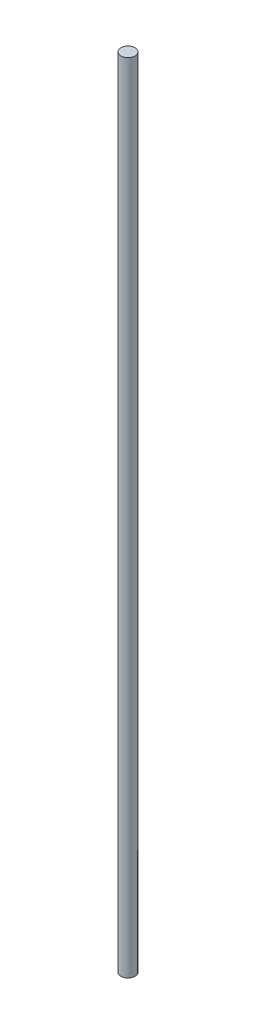
ISO-10303-21;
HEADER;
FILE_DESCRIPTION(('STEP AP214'),'2;1');
FILE_NAME('part.step','',(''),(''),'','','');
FILE_SCHEMA(('AUTOMOTIVE_DESIGN { 1 0 10303 214 1 1 1 1 }'));
ENDSEC;
DATA;
#1=APPLICATION_CONTEXT('core data for automotive mechanical design processes');
#2=APPLICATION_PROTOCOL_DEFINITION('international standard','automotive_design',2000,#1);
#3=PRODUCT_CONTEXT('',#1,'mechanical');
#4=PRODUCT('Part','Part','',(#3));
#5=PRODUCT_RELATED_PRODUCT_CATEGORY('part','',(#4));
#6=PRODUCT_DEFINITION_FORMATION('','',#4);
#7=PRODUCT_DEFINITION_CONTEXT('part definition',#1,'design');
#8=PRODUCT_DEFINITION('design','',#6,#7);
#9=PRODUCT_DEFINITION_SHAPE('','',#8);
#10=(LENGTH_UNIT() NAMED_UNIT(*) SI_UNIT(.MILLI.,.METRE.));
#11=(NAMED_UNIT(*) PLANE_ANGLE_UNIT() SI_UNIT($,.RADIAN.));
#12=(NAMED_UNIT(*) SI_UNIT($,.STERADIAN.) SOLID_ANGLE_UNIT());
#13=UNCERTAINTY_MEASURE_WITH_UNIT(LENGTH_MEASURE(1.E-05),#10,'distance_accuracy_value','');
#14=(GEOMETRIC_REPRESENTATION_CONTEXT(3) GLOBAL_UNCERTAINTY_ASSIGNED_CONTEXT((#13)) GLOBAL_UNIT_ASSIGNED_CONTEXT((#10,
#11,#12)) REPRESENTATION_CONTEXT('',''));
#15=CARTESIAN_POINT('',(0.,0.,0.));
#16=DIRECTION('',(0.,0.,1.));
#17=DIRECTION('',(1.,0.,0.));
#18=AXIS2_PLACEMENT_3D('',#15,#16,#17);
#19=CARTESIAN_POINT('',(0.,177.8,0.));
#20=DIRECTION('',(0.,-1.,0.));
#21=DIRECTION('',(0.,0.,-1.));
#22=AXIS2_PLACEMENT_3D('',#19,#20,#21);
#23=CYLINDRICAL_SURFACE('',#22,1.5875);
#24=CARTESIAN_POINT('',(0.,177.8,0.));
#25=DIRECTION('',(0.,1.,0.));
#26=DIRECTION('',(0.,0.,1.));
#27=AXIS2_PLACEMENT_3D('',#24,#25,#26);
#28=CIRCLE('',#27,1.5875);
#29=CARTESIAN_POINT('',(0.,177.8,1.5875));
#30=VERTEX_POINT('',#29);
#31=EDGE_CURVE('E10',#30,#30,#28,.T.);
#32=ORIENTED_EDGE('',*,*,#31,.F.);
#33=EDGE_LOOP('',(#32));
#34=FACE_BOUND('',#33,.T.);
#35=CARTESIAN_POINT('',(0.,0.,0.));
#36=DIRECTION('',(0.,1.,0.));
#37=DIRECTION('',(0.,0.,1.));
#38=AXIS2_PLACEMENT_3D('',#35,#36,#37);
#39=CIRCLE('',#38,1.5875);
#40=CARTESIAN_POINT('',(0.,0.,1.5875));
#41=VERTEX_POINT('',#40);
#42=EDGE_CURVE('E34',#41,#41,#39,.T.);
#43=ORIENTED_EDGE('',*,*,#42,.T.);
#44=EDGE_LOOP('',(#43));
#45=FACE_BOUND('',#44,.T.);
#46=ADVANCED_FACE('F31',(#34,#45),#23,.T.);
#47=CARTESIAN_POINT('',(0.,177.8,0.));
#48=DIRECTION('',(0.,1.,0.));
#49=DIRECTION('',(0.,0.,1.));
#50=AXIS2_PLACEMENT_3D('',#47,#48,#49);
#51=PLANE('',#50);
#52=ORIENTED_EDGE('',*,*,#31,.T.);
#53=EDGE_LOOP('',(#52));
#54=FACE_BOUND('',#53,.T.);
#55=ADVANCED_FACE('F46',(#54),#51,.T.);
#56=CARTESIAN_POINT('',(0.,0.,0.));
#57=DIRECTION('',(0.,1.,0.));
#58=DIRECTION('',(0.,0.,1.));
#59=AXIS2_PLACEMENT_3D('',#56,#57,#58);
#60=PLANE('',#59);
#61=ORIENTED_EDGE('',*,*,#42,.F.);
#62=EDGE_LOOP('',(#61));
#63=FACE_BOUND('',#62,.T.);
#64=ADVANCED_FACE('F44',(#63),#60,.F.);
#65=CLOSED_SHELL('',(#46,#55,#64));
#66=MANIFOLD_SOLID_BREP('B2',#65);
#67=ADVANCED_BREP_SHAPE_REPRESENTATION('',(#18,#66),#14);
#68=SHAPE_DEFINITION_REPRESENTATION(#9,#67);
ENDSEC;
END-ISO-10303-21;
